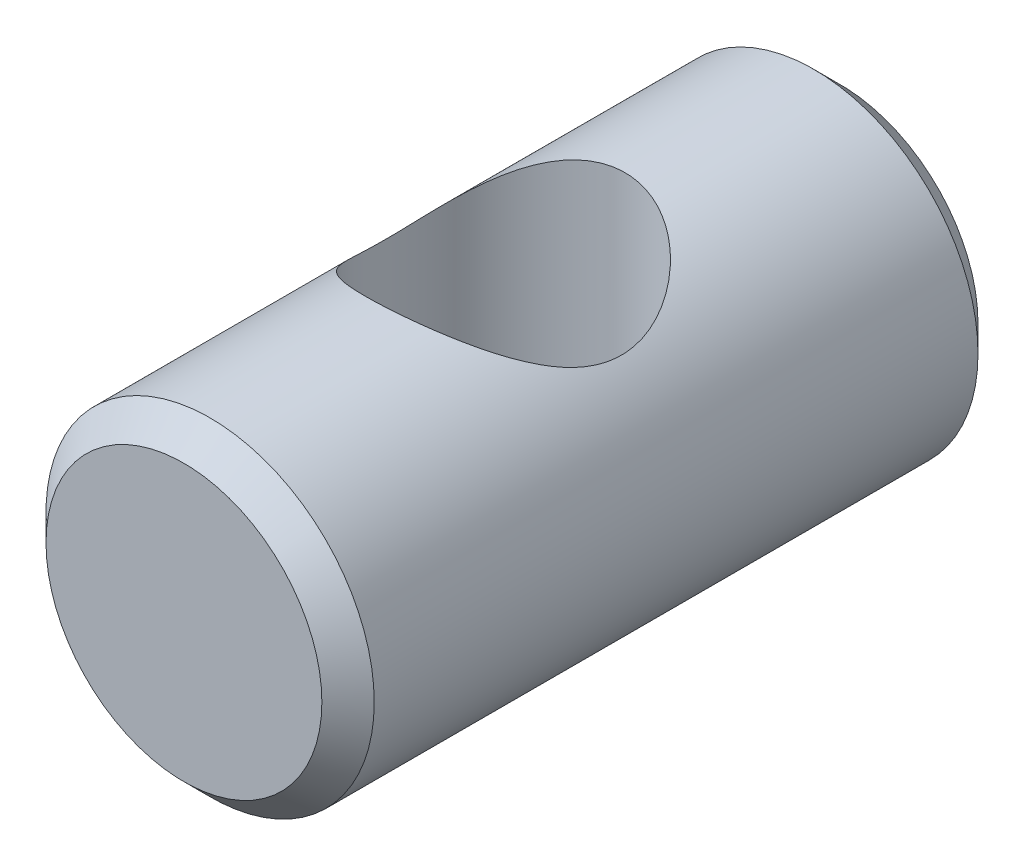
ISO-10303-21;
HEADER;
FILE_DESCRIPTION(('STEP AP214'),'2;1');
FILE_NAME('part.step','',(''),(''),'','','');
FILE_SCHEMA(('AUTOMOTIVE_DESIGN { 1 0 10303 214 1 1 1 1 }'));
ENDSEC;
DATA;
#1=APPLICATION_CONTEXT('core data for automotive mechanical design processes');
#2=APPLICATION_PROTOCOL_DEFINITION('international standard','automotive_design',2000,#1);
#3=PRODUCT_CONTEXT('',#1,'mechanical');
#4=PRODUCT('Part','Part','',(#3));
#5=PRODUCT_RELATED_PRODUCT_CATEGORY('part','',(#4));
#6=PRODUCT_DEFINITION_FORMATION('','',#4);
#7=PRODUCT_DEFINITION_CONTEXT('part definition',#1,'design');
#8=PRODUCT_DEFINITION('design','',#6,#7);
#9=PRODUCT_DEFINITION_SHAPE('','',#8);
#10=(LENGTH_UNIT() NAMED_UNIT(*) SI_UNIT(.MILLI.,.METRE.));
#11=(NAMED_UNIT(*) PLANE_ANGLE_UNIT() SI_UNIT($,.RADIAN.));
#12=(NAMED_UNIT(*) SI_UNIT($,.STERADIAN.) SOLID_ANGLE_UNIT());
#13=UNCERTAINTY_MEASURE_WITH_UNIT(LENGTH_MEASURE(1.E-05),#10,'distance_accuracy_value','');
#14=(GEOMETRIC_REPRESENTATION_CONTEXT(3) GLOBAL_UNCERTAINTY_ASSIGNED_CONTEXT((#13)) GLOBAL_UNIT_ASSIGNED_CONTEXT((#10,
#11,#12)) REPRESENTATION_CONTEXT('',''));
#15=CARTESIAN_POINT('',(0.,0.,0.));
#16=DIRECTION('',(0.,0.,1.));
#17=DIRECTION('',(1.,0.,0.));
#18=AXIS2_PLACEMENT_3D('',#15,#16,#17);
#19=CARTESIAN_POINT('',(0.,0.,9.525));
#20=DIRECTION('',(0.,0.,-1.));
#21=DIRECTION('',(-1.,0.,0.));
#22=AXIS2_PLACEMENT_3D('',#19,#20,#21);
#23=CYLINDRICAL_SURFACE('',#22,4.765);
#24=CARTESIAN_POINT('',(0.,-4.765,-3.42087708051605));
#25=CARTESIAN_POINT('',(-0.0833627581168181,-4.7649997101109,-3.42696899134863));
#26=CARTESIAN_POINT('',(-0.166953392424251,-4.76280757869707,-3.43001003086424));
#27=CARTESIAN_POINT('',(-0.333933182408652,-4.75402028790231,-3.4299899120654));
#28=CARTESIAN_POINT('',(-0.41732223719261,-4.74742325494959,-3.42692615604904));
#29=CARTESIAN_POINT('',(-0.583312250165056,-4.72989865727235,-3.41478160746824));
#30=CARTESIAN_POINT('',(-0.665912068503747,-4.71896558414041,-3.40569315136156));
#31=CARTESIAN_POINT('',(-0.829610597514772,-4.69295834085159,-3.38168739143667));
#32=CARTESIAN_POINT('',(-0.91070865358331,-4.67788240819801,-3.36676760565251));
#33=CARTESIAN_POINT('',(-1.15000632689336,-4.62699847385246,-3.31382161536754));
#34=CARTESIAN_POINT('',(-1.30524951697123,-4.58542013528299,-3.26752778272676));
#35=CARTESIAN_POINT('',(-1.60411463212557,-4.48962808746058,-3.15544383432779));
#36=CARTESIAN_POINT('',(-1.74773682156028,-4.43541466574349,-3.08965416222603));
#37=CARTESIAN_POINT('',(-2.03259497643689,-4.31273538578719,-2.93522566350036));
#38=CARTESIAN_POINT('',(-2.17272279857911,-4.24347672491827,-2.84518090003159));
#39=CARTESIAN_POINT('',(-2.43631552731587,-4.09784606286129,-2.64803347355049));
#40=CARTESIAN_POINT('',(-2.55976291960052,-4.02146672501527,-2.54091313456509));
#41=CARTESIAN_POINT('',(-2.81327393100644,-3.84950291536883,-2.28757037498761));
#42=CARTESIAN_POINT('',(-2.93940806717613,-3.75321839663728,-2.13784494064544));
#43=CARTESIAN_POINT('',(-3.10885207016274,-3.61188607024724,-1.89774924473951));
#44=CARTESIAN_POINT('',(-3.16205944901992,-3.56527135977744,-1.81509327318893));
#45=CARTESIAN_POINT('',(-3.26165283895997,-3.47438917550769,-1.64456461914389));
#46=CARTESIAN_POINT('',(-3.30804141803447,-3.43012082209569,-1.55669391813204));
#47=CARTESIAN_POINT('',(-3.41144333221737,-3.32784018306176,-1.33801732923479));
#48=CARTESIAN_POINT('',(-3.46485738281701,-3.27176419567389,-1.20454764001565));
#49=CARTESIAN_POINT('',(-3.55539465585279,-3.1731532714438,-0.92756721927326));
#50=CARTESIAN_POINT('',(-3.59255605597934,-3.13058666617785,-0.784080947165173));
#51=CARTESIAN_POINT('',(-3.64343651296181,-3.07113542283653,-0.514646140223209));
#52=CARTESIAN_POINT('',(-3.66010628533956,-3.05107413064414,-0.389980532152303));
#53=CARTESIAN_POINT('',(-3.67954153570878,-3.02761567970702,-0.13805144197163));
#54=CARTESIAN_POINT('',(-3.68232117171679,-3.02420155283186,-0.0107907379518655));
#55=CARTESIAN_POINT('',(-3.67376621747767,-3.03458366659267,0.242449329866106));
#56=CARTESIAN_POINT('',(-3.66243797397314,-3.04837216824954,0.368429244158408));
#57=CARTESIAN_POINT('',(-3.62657095184853,-3.09094772918142,0.615927376424316));
#58=CARTESIAN_POINT('',(-3.60201250089043,-3.11975712134959,0.737438661719832));
#59=CARTESIAN_POINT('',(-3.52797021750045,-3.20358122773375,1.02486117239319));
#60=CARTESIAN_POINT('',(-3.47231020523667,-3.26453704351351,1.18741075414518));
#61=CARTESIAN_POINT('',(-3.34017866781708,-3.39961296516166,1.498121783823));
#62=CARTESIAN_POINT('',(-3.2636446149314,-3.47377238661047,1.64623815847782));
#63=CARTESIAN_POINT('',(-3.12200897105521,-3.60054284241464,1.87825971607124));
#64=CARTESIAN_POINT('',(-3.06234750531042,-3.65156363596669,1.9664324955114));
#65=CARTESIAN_POINT('',(-2.93536296354977,-3.75440484501345,2.13658829521524));
#66=CARTESIAN_POINT('',(-2.86803758566651,-3.80622549668558,2.21856944344932));
#67=CARTESIAN_POINT('',(-2.65493557738645,-3.96070606463684,2.4548169203279));
#68=CARTESIAN_POINT('',(-2.4978237985218,-4.06258137631192,2.59972905493882));
#69=CARTESIAN_POINT('',(-2.18575837138569,-4.23718725327564,2.83706621766583));
#70=CARTESIAN_POINT('',(-2.03548298499758,-4.31186637762032,2.93424360521689));
#71=CARTESIAN_POINT('',(-1.71702572980925,-4.44824656330391,3.10568912436018));
#72=CARTESIAN_POINT('',(-1.54887024912961,-4.50996636079323,3.17999040299218));
#73=CARTESIAN_POINT('',(-1.22389848309853,-4.60778480850806,3.29263516387729));
#74=CARTESIAN_POINT('',(-1.06910753325384,-4.64632732736096,3.33468022800881));
#75=CARTESIAN_POINT('',(-0.752190984217971,-4.70801774696666,3.39687013419293));
#76=CARTESIAN_POINT('',(-0.590069112764688,-4.73117337991453,3.4170259792185));
#77=CARTESIAN_POINT('',(-0.262598143568304,-4.7606051003247,3.43390286080124));
#78=CARTESIAN_POINT('',(-0.0972412962651654,-4.76683385814853,3.43055828056669));
#79=CARTESIAN_POINT('',(0.231024129353291,-4.76222706928004,3.40010195996678));
#80=CARTESIAN_POINT('',(0.393932420256084,-4.75138953488968,3.37298745129903));
#81=CARTESIAN_POINT('',(0.705514268669747,-4.71498049061455,3.2979508357131));
#82=CARTESIAN_POINT('',(0.854498752183593,-4.69006694126301,3.25098003249397));
#83=CARTESIAN_POINT('',(1.14256413370517,-4.62833634686259,3.13840780618742));
#84=CARTESIAN_POINT('',(1.28164310390504,-4.59151699239254,3.07280276883643));
#85=CARTESIAN_POINT('',(1.5605913242394,-4.50478911028579,2.91796402171938));
#86=CARTESIAN_POINT('',(1.6992420339739,-4.45396042558585,2.82706121692328));
#87=CARTESIAN_POINT('',(1.96045324775841,-4.34533105232054,2.62789389216064));
#88=CARTESIAN_POINT('',(2.08299871660834,-4.28752394420402,2.51961335554432));
#89=CARTESIAN_POINT('',(2.33061071233595,-4.15886196775128,2.26753986981794));
#90=CARTESIAN_POINT('',(2.45245602746959,-4.08747815085455,2.12084350362776));
#91=CARTESIAN_POINT('',(2.67091966387116,-3.94818744226299,1.80818256348861));
#92=CARTESIAN_POINT('',(2.76753692468301,-3.88028069682256,1.64221717999394));
#93=CARTESIAN_POINT('',(2.91829752704228,-3.76775877390235,1.32363316444147));
#94=CARTESIAN_POINT('',(2.97693831230802,-3.72114907301219,1.17388770573105));
#95=CARTESIAN_POINT('',(3.04915600293589,-3.66180847873486,0.941826581338293));
#96=CARTESIAN_POINT('',(3.0706008978109,-3.64379412637323,0.863255129060434));
#97=CARTESIAN_POINT('',(3.10797188341904,-3.61197174564401,0.703992654043788));
#98=CARTESIAN_POINT('',(3.12390068817333,-3.59816164910817,0.623302694735672));
#99=CARTESIAN_POINT('',(3.15010468685879,-3.57524455910332,0.459495462666018));
#100=CARTESIAN_POINT('',(3.16032158062367,-3.5661861203942,0.376361962516616));
#101=CARTESIAN_POINT('',(3.17464168800661,-3.55344451616001,0.209195138832912));
#102=CARTESIAN_POINT('',(3.17874788699032,-3.54975872585817,0.125162274904956));
#103=CARTESIAN_POINT('',(3.18076053743013,-3.54795587812489,-0.0430393452037649));
#104=CARTESIAN_POINT('',(3.17866722999484,-3.54983860412504,-0.127208095972433));
#105=CARTESIAN_POINT('',(3.16833758034576,-3.55905933774995,-0.294840628996076));
#106=CARTESIAN_POINT('',(3.16010150131517,-3.56639711165655,-0.378304441298765));
#107=CARTESIAN_POINT('',(3.129430196119,-3.59341005189328,-0.604314657609784));
#108=CARTESIAN_POINT('',(3.10101793603989,-3.61818171011667,-0.745494317394035));
#109=CARTESIAN_POINT('',(3.02771937958645,-3.67972750014127,-1.02069983126741));
#110=CARTESIAN_POINT('',(2.98281650470617,-3.71651370639189,-1.1547183301723));
#111=CARTESIAN_POINT('',(2.8560768918245,-3.8153502491925,-1.46853642894096));
#112=CARTESIAN_POINT('',(2.76664814536404,-3.88152734494911,-1.64398166227299));
#113=CARTESIAN_POINT('',(2.56077346334119,-4.02033820070584,-1.97551522842484));
#114=CARTESIAN_POINT('',(2.44428083509274,-4.09298298410994,-2.13156938380249));
#115=CARTESIAN_POINT('',(2.18450650401399,-4.2373970566927,-2.42421216807333));
#116=CARTESIAN_POINT('',(2.04090097393914,-4.30914323590253,-2.56052605726515));
#117=CARTESIAN_POINT('',(1.72973058522059,-4.44318432752426,-2.80802181758102));
#118=CARTESIAN_POINT('',(1.56219804304704,-4.50549175797245,-2.91923707314102));
#119=CARTESIAN_POINT('',(1.23969583506405,-4.60338031575656,-3.09396462152008));
#120=CARTESIAN_POINT('',(1.08834922542924,-4.64178783933997,-3.16252149709775));
#121=CARTESIAN_POINT('',(0.85338781071092,-4.68864069192958,-3.24875451241662));
#122=CARTESIAN_POINT('',(0.773800863355168,-4.70245945854321,-3.27471971164357));
#123=CARTESIAN_POINT('',(0.612411306870997,-4.72618391319332,-3.32087000112459));
#124=CARTESIAN_POINT('',(0.530609679466058,-4.73609130567107,-3.34105760799584));
#125=CARTESIAN_POINT('',(0.374335243630177,-4.75084997254152,-3.37353939001354));
#126=CARTESIAN_POINT('',(0.300030947704158,-4.75613339853629,-3.38645258471521));
#127=CARTESIAN_POINT('',(0.150546671086999,-4.76320900575073,-3.40736829831093));
#128=CARTESIAN_POINT('',(0.0753664637160969,-4.76500026208246,-3.41536951590209));
#129=CARTESIAN_POINT('',(0.,-4.765,-3.42087708051605));
#130=B_SPLINE_CURVE_WITH_KNOTS('',3,(#24,#25,#26,#27,#28,#29,#30,#31,#32,#33,#34,#35,#36,#37,
#38,#39,#40,#41,#42,#43,#44,#45,#46,#47,#48,#49,#50,#51,#52,#53,#54,#55,#56,#57,#58,#59,#60,#61,
#62,#63,#64,#65,#66,#67,#68,#69,#70,#71,#72,#73,#74,#75,#76,#77,#78,#79,#80,#81,#82,#83,#84,#85,
#86,#87,#88,#89,#90,#91,#92,#93,#94,#95,#96,#97,#98,#99,#100,#101,#102,#103,#104,#105,#106,#107,
#108,#109,#110,#111,#112,#113,#114,#115,#116,#117,#118,#119,#120,#121,#122,#123,#124,#125,#126,
#127,#128,#129),.UNSPECIFIED.,.T.,.F.,(4,2,2,2,2,2,2,2,2,2,2,2,2,2,2,2,2,2,2,2,2,2,2,2,2,2,2,2,
2,2,2,2,2,2,2,2,2,2,2,2,2,2,2,2,2,2,2,2,2,2,2,2,4),(0.,0.250678148817341,0.501462988541287,
0.752567445437252,1.00377889552888,1.50309474088369,2.00239922444642,2.54160992918404,
3.08138247258981,3.73300244855075,4.05909733145616,4.38506908912952,4.84654436743379,
5.30692973453839,5.68734604359481,6.06737452056514,6.44723209503533,6.82765605484285,
7.37157480546313,7.91714109472133,8.27090631470675,8.62477807035776,9.33119791439566,
9.91077027397039,10.4894988486046,10.9822712500665,11.4747958366297,11.9686961727678,
12.4626540373564,12.9352342359093,13.4079061579591,13.9261848288361,14.4449439577642,
15.0533142145202,15.6617100398796,16.1619385675779,16.4119146790501,16.6617676221917,
16.9141262556176,17.1663615593023,17.4185870532858,17.6708017414467,18.1072101440206,
18.5440584873629,19.1640002904501,19.7850197135797,20.4139885307568,21.0421157411608,
21.5513660687497,21.8056438515067,22.059810706191,22.2863833912941,22.5130160751694),.UNSPECIFIED.);
#131=CARTESIAN_POINT('',(0.,-4.765,-3.42087708051605));
#132=VERTEX_POINT('',#131);
#133=EDGE_CURVE('E10',#132,#132,#130,.T.);
#134=ORIENTED_EDGE('',*,*,#133,.T.);
#135=EDGE_LOOP('',(#134));
#136=FACE_BOUND('',#135,.T.);
#137=CARTESIAN_POINT('',(-0.25,4.75843724346555,3.43));
#138=CARTESIAN_POINT('',(-0.422180009069406,4.749390618167,3.42999980483541));
#139=CARTESIAN_POINT('',(-0.59386282730199,4.73091871113112,3.41695856293195));
#140=CARTESIAN_POINT('',(-0.930629104770302,4.67635636796384,3.36610979440147));
#141=CARTESIAN_POINT('',(-1.09570851357914,4.64025529237457,3.32828730721862));
#142=CARTESIAN_POINT('',(-1.41392411864396,4.55336447971862,3.23075051942857));
#143=CARTESIAN_POINT('',(-1.56712334101048,4.5026601113221,3.17116292636266));
#144=CARTESIAN_POINT('',(-1.85998836726663,4.38979766700268,3.03299834240104));
#145=CARTESIAN_POINT('',(-1.99965414606241,4.32763956984278,2.95442131629586));
#146=CARTESIAN_POINT('',(-2.27820698899914,4.18828982189439,2.77162910883962));
#147=CARTESIAN_POINT('',(-2.41542819149111,4.11020218068904,2.66557505303866));
#148=CARTESIAN_POINT('',(-2.67111072919315,3.94883137284482,2.43572487373919));
#149=CARTESIAN_POINT('',(-2.78953546002451,3.86553849846079,2.31189500490524));
#150=CARTESIAN_POINT('',(-2.96344629098398,3.732292646302,2.10063521621267));
#151=CARTESIAN_POINT('',(-3.02522112465854,3.68226630299909,2.01833701427756));
#152=CARTESIAN_POINT('',(-3.14150590868554,3.58357003530251,1.84790207991889));
#153=CARTESIAN_POINT('',(-3.1960131207988,3.5349006275963,1.7597631654945));
#154=CARTESIAN_POINT('',(-3.29731229261899,3.44060115304685,1.57784833521895));
#155=CARTESIAN_POINT('',(-3.34411822611588,3.39496567295495,1.48408305992192));
#156=CARTESIAN_POINT('',(-3.42959137880208,3.30859742398812,1.29083456033672));
#157=CARTESIAN_POINT('',(-3.46826509160405,3.2678607546062,1.19135597958454));
#158=CARTESIAN_POINT('',(-3.54347659526858,3.18632211811376,0.966712328692861));
#159=CARTESIAN_POINT('',(-3.57812346664731,3.14705996480953,0.840323998552468));
#160=CARTESIAN_POINT('',(-3.63302442402354,3.08352956814293,0.580976208361932));
#161=CARTESIAN_POINT('',(-3.65331272726122,3.05922569654856,0.448033183521057));
#162=CARTESIAN_POINT('',(-3.67812283683354,3.02936636632518,0.177337549423231));
#163=CARTESIAN_POINT('',(-3.68251233934075,3.02396824643502,0.0395541719109347));
#164=CARTESIAN_POINT('',(-3.67470644643728,3.03344305810687,-0.234875874606968));
#165=CARTESIAN_POINT('',(-3.66249943392474,3.04833018879986,-0.37152167996018));
#166=CARTESIAN_POINT('',(-3.62015799382368,3.09852315491188,-0.655828380639309));
#167=CARTESIAN_POINT('',(-3.58799174144691,3.13612809889826,-0.802759414360211));
#168=CARTESIAN_POINT('',(-3.50660899556505,3.22685391573891,-1.08690765852793));
#169=CARTESIAN_POINT('',(-3.45734815065714,3.28001509196861,-1.22409847190397));
#170=CARTESIAN_POINT('',(-3.35999029035731,3.37921222953507,-1.45031682658415));
#171=CARTESIAN_POINT('',(-3.31552748835515,3.42299124550292,-1.54196683547208));
#172=CARTESIAN_POINT('',(-3.21937168211258,3.51357799533849,-1.7198719105116));
#173=CARTESIAN_POINT('',(-3.16767569861283,3.56038697291961,-1.80612473233373));
#174=CARTESIAN_POINT('',(-3.05733519065029,3.655577234441,-1.97327341136436));
#175=CARTESIAN_POINT('',(-2.99868376029761,3.70396004583247,-2.05416381804875));
#176=CARTESIAN_POINT('',(-2.87465956601933,3.80102084509467,-2.21043246978884));
#177=CARTESIAN_POINT('',(-2.80928649472037,3.84969884636825,-2.28581046249783));
#178=CARTESIAN_POINT('',(-2.6702557671566,3.94744940552613,-2.43263894546763));
#179=CARTESIAN_POINT('',(-2.59643405525365,3.99650228404323,-2.50394748039488));
#180=CARTESIAN_POINT('',(-2.44198609531555,4.09270177982323,-2.64020867362414));
#181=CARTESIAN_POINT('',(-2.36135999487914,4.13984843840247,-2.70516146972696));
#182=CARTESIAN_POINT('',(-2.19361254846785,4.2311207520192,-2.82808330517596));
#183=CARTESIAN_POINT('',(-2.10650409604225,4.27525208591359,-2.88606563800173));
#184=CARTESIAN_POINT('',(-1.92594548966524,4.3595756679867,-2.99452956360935));
#185=CARTESIAN_POINT('',(-1.8324951446076,4.39976779737236,-3.04501093021117));
#186=CARTESIAN_POINT('',(-1.58991791011193,4.49465680101692,-3.16160717844564));
#187=CARTESIAN_POINT('',(-1.43688887677842,4.54617300319559,-3.22239703143537));
#188=CARTESIAN_POINT('',(-1.11985321098478,4.63445714602499,-3.3220213557935));
#189=CARTESIAN_POINT('',(-0.955854490731875,4.67123558567514,-3.36087146486794));
#190=CARTESIAN_POINT('',(-0.620041304864638,4.72756501903715,-3.41423360193657));
#191=CARTESIAN_POINT('',(-0.448189976813925,4.74702354164412,-3.42861536060857));
#192=CARTESIAN_POINT('',(-0.10319553205656,4.76701209164517,-3.43119218349009));
#193=CARTESIAN_POINT('',(0.069947271391446,4.76754656888776,-3.41939340455174));
#194=CARTESIAN_POINT('',(0.396800733953032,4.75102741592386,-3.37216085402572));
#195=CARTESIAN_POINT('',(0.550903795546911,4.73547935394817,-3.33884247322146));
#196=CARTESIAN_POINT('',(0.851262679297079,4.69080460019725,-3.25216372524372));
#197=CARTESIAN_POINT('',(0.997516834516369,4.66167503663273,-3.19879911978834));
#198=CARTESIAN_POINT('',(1.28614476637547,4.59066745677348,-3.07104032256261));
#199=CARTESIAN_POINT('',(1.42797966766526,4.5482360225696,-2.99574591149817));
#200=CARTESIAN_POINT('',(1.69771873358212,4.45459184021555,-2.82781924377908));
#201=CARTESIAN_POINT('',(1.82561916137349,4.40337674596602,-2.73518235437366));
#202=CARTESIAN_POINT('',(2.08559098582612,4.28706511495821,-2.51852707855975));
#203=CARTESIAN_POINT('',(2.2150420244168,4.22105957781513,-2.39185853378127));
#204=CARTESIAN_POINT('',(2.4525288591269,4.08765163666692,-2.119882962336));
#205=CARTESIAN_POINT('',(2.56051870491994,4.02024656957631,-1.97453701758847));
#206=CARTESIAN_POINT('',(2.71141297716131,3.91890470250436,-1.73364032653499));
#207=CARTESIAN_POINT('',(2.76225962831151,3.88310759046258,-1.64375989611527));
#208=CARTESIAN_POINT('',(2.85606768069206,3.81463871939836,-1.45876664530863));
#209=CARTESIAN_POINT('',(2.8990272649147,3.78196768138303,-1.36365262576039));
#210=CARTESIAN_POINT('',(2.97638382467227,3.7213945324715,-1.16888238761678));
#211=CARTESIAN_POINT('',(3.01080676435227,3.6934780438477,-1.06924106056856));
#212=CARTESIAN_POINT('',(3.07061216797024,3.64390866973889,-0.865836413850732));
#213=CARTESIAN_POINT('',(3.09600079900905,3.62225151334222,-0.762075960014793));
#214=CARTESIAN_POINT('',(3.14431905107756,3.58048576732931,-0.51427610984992));
#215=CARTESIAN_POINT('',(3.1632690781055,3.56357947310397,-0.36886387726438));
#216=CARTESIAN_POINT('',(3.18229415057448,3.54660528363273,-0.0759553160984843));
#217=CARTESIAN_POINT('',(3.18238833621043,3.54652031339164,0.0715387471135818));
#218=CARTESIAN_POINT('',(3.16376347579515,3.56313911837427,0.36412784346974));
#219=CARTESIAN_POINT('',(3.14506985693007,3.57982020262542,0.509225849632981));
#220=CARTESIAN_POINT('',(3.09006178812863,3.6274007096972,0.793694678976364));
#221=CARTESIAN_POINT('',(3.05372153995533,3.65832094581284,0.933056792070445));
#222=CARTESIAN_POINT('',(2.94995679839854,3.74283457822027,1.249627259653));
#223=CARTESIAN_POINT('',(2.87616913174531,3.80056128592335,1.42363336901504));
#224=CARTESIAN_POINT('',(2.70309172031867,3.9255469405295,1.75476054116614));
#225=CARTESIAN_POINT('',(2.60375916203549,3.99282180458683,1.91185262262683));
#226=CARTESIAN_POINT('',(2.37965965281677,4.13038218124549,2.21024978907531));
#227=CARTESIAN_POINT('',(2.25446848393284,4.20070005001654,2.35122119961121));
#228=CARTESIAN_POINT('',(1.98132226028618,4.33621841215064,2.61183089931648));
#229=CARTESIAN_POINT('',(1.83339056066265,4.40142405331531,2.73149080683867));
#230=CARTESIAN_POINT('',(1.53413492006617,4.51378899534322,2.93439863762912));
#231=CARTESIAN_POINT('',(1.38501302638156,4.56214832085995,3.02021473285691));
#232=CARTESIAN_POINT('',(1.07249564524745,4.64554146755817,3.16951406225263));
#233=CARTESIAN_POINT('',(0.909111289256103,4.68058556855773,3.23301452201411));
#234=CARTESIAN_POINT('',(0.581478494873657,4.73212589223905,3.33183530764178));
#235=CARTESIAN_POINT('',(0.417802064196769,4.74955942472212,3.36854686433097));
#236=CARTESIAN_POINT('',(0.0859254534274418,4.76711849433294,3.41762518536938));
#237=CARTESIAN_POINT('',(-0.0822731758795955,4.76724989098796,3.43000019011695));
#238=CARTESIAN_POINT('',(-0.25,4.75843724346555,3.43));
#239=B_SPLINE_CURVE_WITH_KNOTS('',3,(#137,#138,#139,#140,#141,#142,#143,#144,#145,#146,#147,
#148,#149,#150,#151,#152,#153,#154,#155,#156,#157,#158,#159,#160,#161,#162,#163,#164,#165,#166,
#167,#168,#169,#170,#171,#172,#173,#174,#175,#176,#177,#178,#179,#180,#181,#182,#183,#184,#185,
#186,#187,#188,#189,#190,#191,#192,#193,#194,#195,#196,#197,#198,#199,#200,#201,#202,#203,#204,
#205,#206,#207,#208,#209,#210,#211,#212,#213,#214,#215,#216,#217,#218,#219,#220,#221,#222,#223,
#224,#225,#226,#227,#228,#229,#230,#231,#232,#233,#234,#235,#236,#237,#238),.UNSPECIFIED.,.T.,
.F.,(4,2,2,2,2,2,2,2,2,2,2,2,2,2,2,2,2,2,2,2,2,2,2,2,2,2,2,2,2,2,2,2,2,2,2,2,2,2,2,2,2,2,2,2,2,
2,2,2,2,2,4),(0.,0.516551025096824,1.03341418220019,1.54731512007828,2.06121701081903,
2.62982932183038,3.19953571462131,3.54246459279583,3.88552231417978,4.22795053195655,
4.57010427222594,4.97905439316964,5.38702665221778,5.79838620186915,6.21003384012951,
6.67262967068467,7.1364347778277,7.46866532411958,7.80103311718076,8.13373371721725,
8.46644953806418,8.80733809568013,9.14821926074384,9.48843965067855,9.82867029735156,
10.3440014803113,10.8589648922706,11.3766614843259,11.8942363430695,12.3673901670618,
12.8406440841658,13.3370245096255,13.8335377244494,14.4096746680997,14.9870321881218,
15.3145391492316,15.6421214663625,15.968694875667,16.2950449261748,16.7357599059526,
17.1760275223247,17.6157000871626,18.0560173690192,18.6457302885718,19.2364380888803,
19.8377403374759,20.4384291081866,20.9723943239786,21.5059464582794,22.0093081125728,
22.5124992983782),.UNSPECIFIED.);
#240=CARTESIAN_POINT('',(-0.25,4.75843724346555,3.43));
#241=VERTEX_POINT('',#240);
#242=EDGE_CURVE('E57',#241,#241,#239,.T.);
#243=ORIENTED_EDGE('',*,*,#242,.T.);
#244=EDGE_LOOP('',(#243));
#245=FACE_BOUND('',#244,.T.);
#246=CARTESIAN_POINT('',(0.,0.,-8.76499999999999));
#247=DIRECTION('',(0.,0.,1.));
#248=DIRECTION('',(1.,0.,0.));
#249=AXIS2_PLACEMENT_3D('',#246,#247,#248);
#250=CIRCLE('',#249,4.765);
#251=CARTESIAN_POINT('',(4.765,0.,-8.76499999999999));
#252=VERTEX_POINT('',#251);
#253=EDGE_CURVE('E100',#252,#252,#250,.T.);
#254=ORIENTED_EDGE('',*,*,#253,.T.);
#255=EDGE_LOOP('',(#254));
#256=FACE_BOUND('',#255,.T.);
#257=CARTESIAN_POINT('',(0.,0.,8.76500000000001));
#258=DIRECTION('',(0.,0.,1.));
#259=DIRECTION('',(1.,0.,0.));
#260=AXIS2_PLACEMENT_3D('',#257,#258,#259);
#261=CIRCLE('',#260,4.765);
#262=CARTESIAN_POINT('',(4.765,0.,8.76500000000001));
#263=VERTEX_POINT('',#262);
#264=EDGE_CURVE('E103',#263,#263,#261,.F.);
#265=ORIENTED_EDGE('',*,*,#264,.T.);
#266=EDGE_LOOP('',(#265));
#267=FACE_BOUND('',#266,.T.);
#268=ADVANCED_FACE('F43',(#136,#245,#256,#267),#23,.T.);
#269=CARTESIAN_POINT('',(0.,0.,9.525));
#270=DIRECTION('',(0.,0.,1.));
#271=DIRECTION('',(1.,0.,0.));
#272=AXIS2_PLACEMENT_3D('',#269,#270,#271);
#273=PLANE('',#272);
#274=CARTESIAN_POINT('',(0.,0.,9.525));
#275=DIRECTION('',(0.,0.,1.));
#276=DIRECTION('',(1.,0.,0.));
#277=AXIS2_PLACEMENT_3D('',#274,#275,#276);
#278=CIRCLE('',#277,4.00500000000001);
#279=CARTESIAN_POINT('',(4.00500000000001,0.,9.525));
#280=VERTEX_POINT('',#279);
#281=EDGE_CURVE('E62',#280,#280,#278,.T.);
#282=ORIENTED_EDGE('',*,*,#281,.T.);
#283=EDGE_LOOP('',(#282));
#284=FACE_BOUND('',#283,.T.);
#285=ADVANCED_FACE('F80',(#284),#273,.T.);
#286=CARTESIAN_POINT('',(0.,0.,-9.525));
#287=DIRECTION('',(0.,0.,1.));
#288=DIRECTION('',(1.,0.,0.));
#289=AXIS2_PLACEMENT_3D('',#286,#287,#288);
#290=PLANE('',#289);
#291=CARTESIAN_POINT('',(0.,0.,-9.525));
#292=DIRECTION('',(0.,0.,1.));
#293=DIRECTION('',(1.,0.,0.));
#294=AXIS2_PLACEMENT_3D('',#291,#292,#293);
#295=CIRCLE('',#294,4.00499999999998);
#296=CARTESIAN_POINT('',(4.00499999999998,0.,-9.525));
#297=VERTEX_POINT('',#296);
#298=EDGE_CURVE('E67',#297,#297,#295,.F.);
#299=ORIENTED_EDGE('',*,*,#298,.T.);
#300=EDGE_LOOP('',(#299));
#301=FACE_BOUND('',#300,.T.);
#302=ADVANCED_FACE('F83',(#301),#290,.F.);
#303=CARTESIAN_POINT('',(0.,0.,-8.76499999999999));
#304=DIRECTION('',(0.,0.,1.));
#305=DIRECTION('',(1.,0.,0.));
#306=AXIS2_PLACEMENT_3D('',#303,#304,#305);
#307=CONICAL_SURFACE('',#306,4.765,0.785398163397451);
#308=ORIENTED_EDGE('',*,*,#298,.F.);
#309=EDGE_LOOP('',(#308));
#310=FACE_BOUND('',#309,.T.);
#311=ORIENTED_EDGE('',*,*,#253,.F.);
#312=EDGE_LOOP('',(#311));
#313=FACE_BOUND('',#312,.T.);
#314=ADVANCED_FACE('F86',(#310,#313),#307,.T.);
#315=CARTESIAN_POINT('',(0.,0.,9.525));
#316=DIRECTION('',(0.,0.,-1.));
#317=DIRECTION('',(-1.,0.,0.));
#318=AXIS2_PLACEMENT_3D('',#315,#316,#317);
#319=CONICAL_SURFACE('',#318,4.00500000000001,0.785398163397448);
#320=ORIENTED_EDGE('',*,*,#264,.F.);
#321=EDGE_LOOP('',(#320));
#322=FACE_BOUND('',#321,.T.);
#323=ORIENTED_EDGE('',*,*,#281,.F.);
#324=EDGE_LOOP('',(#323));
#325=FACE_BOUND('',#324,.T.);
#326=ADVANCED_FACE('F46',(#322,#325),#319,.T.);
#327=CARTESIAN_POINT('',(-0.25,-4.765,0.));
#328=DIRECTION('',(0.,1.,0.));
#329=DIRECTION('',(0.,0.,1.));
#330=AXIS2_PLACEMENT_3D('',#327,#328,#329);
#331=CYLINDRICAL_SURFACE('',#330,3.43);
#332=ORIENTED_EDGE('',*,*,#242,.F.);
#333=EDGE_LOOP('',(#332));
#334=FACE_BOUND('',#333,.T.);
#335=ORIENTED_EDGE('',*,*,#133,.F.);
#336=EDGE_LOOP('',(#335));
#337=FACE_BOUND('',#336,.T.);
#338=ADVANCED_FACE('F75',(#334,#337),#331,.F.);
#339=CLOSED_SHELL('',(#268,#285,#302,#314,#326,#338));
#340=MANIFOLD_SOLID_BREP('B2',#339);
#341=ADVANCED_BREP_SHAPE_REPRESENTATION('',(#18,#340),#14);
#342=SHAPE_DEFINITION_REPRESENTATION(#9,#341);
ENDSEC;
END-ISO-10303-21;
